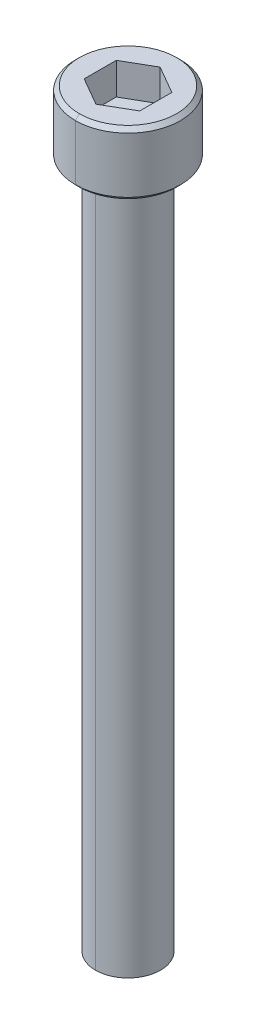
ISO-10303-21;
HEADER;
FILE_DESCRIPTION(('STEP AP214'),'2;1');
FILE_NAME('part.step','',(''),(''),'','','');
FILE_SCHEMA(('AUTOMOTIVE_DESIGN { 1 0 10303 214 1 1 1 1 }'));
ENDSEC;
DATA;
#1=APPLICATION_CONTEXT('core data for automotive mechanical design processes');
#2=APPLICATION_PROTOCOL_DEFINITION('international standard','automotive_design',2000,#1);
#3=PRODUCT_CONTEXT('',#1,'mechanical');
#4=PRODUCT('Part','Part','',(#3));
#5=PRODUCT_RELATED_PRODUCT_CATEGORY('part','',(#4));
#6=PRODUCT_DEFINITION_FORMATION('','',#4);
#7=PRODUCT_DEFINITION_CONTEXT('part definition',#1,'design');
#8=PRODUCT_DEFINITION('design','',#6,#7);
#9=PRODUCT_DEFINITION_SHAPE('','',#8);
#10=(LENGTH_UNIT() NAMED_UNIT(*) SI_UNIT(.MILLI.,.METRE.));
#11=(NAMED_UNIT(*) PLANE_ANGLE_UNIT() SI_UNIT($,.RADIAN.));
#12=(NAMED_UNIT(*) SI_UNIT($,.STERADIAN.) SOLID_ANGLE_UNIT());
#13=UNCERTAINTY_MEASURE_WITH_UNIT(LENGTH_MEASURE(1.E-05),#10,'distance_accuracy_value','');
#14=(GEOMETRIC_REPRESENTATION_CONTEXT(3) GLOBAL_UNCERTAINTY_ASSIGNED_CONTEXT((#13)) GLOBAL_UNIT_ASSIGNED_CONTEXT((#10,
#11,#12)) REPRESENTATION_CONTEXT('',''));
#15=CARTESIAN_POINT('',(0.,0.,0.));
#16=DIRECTION('',(0.,0.,1.));
#17=DIRECTION('',(1.,0.,0.));
#18=AXIS2_PLACEMENT_3D('',#15,#16,#17);
#19=CARTESIAN_POINT('',(0.,-43.91152,0.));
#20=DIRECTION('',(0.,1.,0.));
#21=DIRECTION('',(0.,0.,1.));
#22=AXIS2_PLACEMENT_3D('',#19,#20,#21);
#23=CONICAL_SURFACE('',#22,2.0828,0.960291895410485);
#24=DIRECTION('',(0.,0.573280843383966,-0.819358941251616));
#25=VECTOR('',#24,1.);
#26=CARTESIAN_POINT('',(0.,-43.91152,-2.0828));
#27=LINE('',#26,#25);
#28=CARTESIAN_POINT('',(0.,-44.45,-1.31318));
#29=VERTEX_POINT('',#28);
#30=CARTESIAN_POINT('',(0.,-43.91152,-2.0828));
#31=VERTEX_POINT('',#30);
#32=EDGE_CURVE('E164',#29,#31,#27,.T.);
#33=ORIENTED_EDGE('',*,*,#32,.F.);
#34=CARTESIAN_POINT('',(0.,-44.45,0.));
#35=DIRECTION('',(0.,-1.,0.));
#36=DIRECTION('',(0.,0.,1.));
#37=AXIS2_PLACEMENT_3D('',#34,#35,#36);
#38=CIRCLE('',#37,1.31318);
#39=CARTESIAN_POINT('',(0.,-44.45,1.31318));
#40=VERTEX_POINT('',#39);
#41=EDGE_CURVE('E175',#40,#29,#38,.T.);
#42=ORIENTED_EDGE('',*,*,#41,.F.);
#43=DIRECTION('',(0.,0.573280843383966,0.819358941251616));
#44=VECTOR('',#43,1.);
#45=CARTESIAN_POINT('',(0.,-43.91152,2.0828));
#46=LINE('',#45,#44);
#47=CARTESIAN_POINT('',(0.,-43.91152,2.0828));
#48=VERTEX_POINT('',#47);
#49=EDGE_CURVE('E134',#40,#48,#46,.T.);
#50=ORIENTED_EDGE('',*,*,#49,.T.);
#51=CARTESIAN_POINT('',(0.,-43.91152,0.));
#52=DIRECTION('',(0.,1.,0.));
#53=DIRECTION('',(0.,0.,1.));
#54=AXIS2_PLACEMENT_3D('',#51,#52,#53);
#55=CIRCLE('',#54,2.0828);
#56=EDGE_CURVE('E211',#31,#48,#55,.T.);
#57=ORIENTED_EDGE('',*,*,#56,.F.);
#58=EDGE_LOOP('',(#33,#42,#50,#57));
#59=FACE_BOUND('',#58,.T.);
#60=ADVANCED_FACE('F17',(#59),#23,.T.);
#61=CARTESIAN_POINT('',(0.,0.254,0.));
#62=DIRECTION('',(0.,1.,0.));
#63=DIRECTION('',(0.,0.,1.));
#64=AXIS2_PLACEMENT_3D('',#61,#62,#63);
#65=CONICAL_SURFACE('',#64,3.3655,0.785398163397457);
#66=DIRECTION('',(0.,0.707106781186541,-0.707106781186554));
#67=VECTOR('',#66,1.);
#68=CARTESIAN_POINT('',(0.,0.254,-3.3655));
#69=LINE('',#68,#67);
#70=CARTESIAN_POINT('',(0.,0.,-3.1115));
#71=VERTEX_POINT('',#70);
#72=CARTESIAN_POINT('',(0.,0.254,-3.3655));
#73=VERTEX_POINT('',#72);
#74=EDGE_CURVE('E123',#71,#73,#69,.T.);
#75=ORIENTED_EDGE('',*,*,#74,.F.);
#76=CARTESIAN_POINT('',(0.,0.,0.));
#77=DIRECTION('',(0.,-1.,0.));
#78=DIRECTION('',(0.,0.,1.));
#79=AXIS2_PLACEMENT_3D('',#76,#77,#78);
#80=CIRCLE('',#79,3.1115);
#81=CARTESIAN_POINT('',(0.,0.,3.1115));
#82=VERTEX_POINT('',#81);
#83=EDGE_CURVE('E110',#82,#71,#80,.T.);
#84=ORIENTED_EDGE('',*,*,#83,.F.);
#85=DIRECTION('',(0.,0.707106781186541,0.707106781186554));
#86=VECTOR('',#85,1.);
#87=CARTESIAN_POINT('',(0.,0.254,3.3655));
#88=LINE('',#87,#86);
#89=CARTESIAN_POINT('',(0.,0.254,3.3655));
#90=VERTEX_POINT('',#89);
#91=EDGE_CURVE('E132',#82,#90,#88,.T.);
#92=ORIENTED_EDGE('',*,*,#91,.T.);
#93=CARTESIAN_POINT('',(0.,0.254,0.));
#94=DIRECTION('',(0.,1.,0.));
#95=DIRECTION('',(0.,0.,1.));
#96=AXIS2_PLACEMENT_3D('',#93,#94,#95);
#97=CIRCLE('',#96,3.3655);
#98=EDGE_CURVE('E124',#73,#90,#97,.T.);
#99=ORIENTED_EDGE('',*,*,#98,.F.);
#100=EDGE_LOOP('',(#75,#84,#92,#99));
#101=FACE_BOUND('',#100,.T.);
#102=ADVANCED_FACE('F19',(#101),#65,.T.);
#103=CARTESIAN_POINT('',(0.,4.064,0.));
#104=DIRECTION('',(0.,-1.,0.));
#105=DIRECTION('',(0.,0.,-1.));
#106=AXIS2_PLACEMENT_3D('',#103,#104,#105);
#107=CONICAL_SURFACE('',#106,3.1115,0.785398163397452);
#108=DIRECTION('',(0.,-0.707106781186545,0.707106781186551));
#109=VECTOR('',#108,1.);
#110=CARTESIAN_POINT('',(0.,4.064,3.1115));
#111=LINE('',#110,#109);
#112=CARTESIAN_POINT('',(0.,4.064,3.1115));
#113=VERTEX_POINT('',#112);
#114=CARTESIAN_POINT('',(0.,3.81,3.3655));
#115=VERTEX_POINT('',#114);
#116=EDGE_CURVE('E224',#113,#115,#111,.T.);
#117=ORIENTED_EDGE('',*,*,#116,.F.);
#118=CARTESIAN_POINT('',(0.,4.064,0.));
#119=DIRECTION('',(0.,1.,0.));
#120=DIRECTION('',(0.,0.,1.));
#121=AXIS2_PLACEMENT_3D('',#118,#119,#120);
#122=CIRCLE('',#121,3.1115);
#123=CARTESIAN_POINT('',(0.,4.064,-3.1115));
#124=VERTEX_POINT('',#123);
#125=EDGE_CURVE('E205',#124,#113,#122,.T.);
#126=ORIENTED_EDGE('',*,*,#125,.F.);
#127=DIRECTION('',(0.,-0.707106781186545,-0.707106781186551));
#128=VECTOR('',#127,1.);
#129=CARTESIAN_POINT('',(0.,4.064,-3.1115));
#130=LINE('',#129,#128);
#131=CARTESIAN_POINT('',(0.,3.81,-3.3655));
#132=VERTEX_POINT('',#131);
#133=EDGE_CURVE('E228',#124,#132,#130,.T.);
#134=ORIENTED_EDGE('',*,*,#133,.T.);
#135=CARTESIAN_POINT('',(0.,3.81,0.));
#136=DIRECTION('',(0.,-1.,0.));
#137=DIRECTION('',(0.,0.,1.));
#138=AXIS2_PLACEMENT_3D('',#135,#136,#137);
#139=CIRCLE('',#138,3.3655);
#140=EDGE_CURVE('E172',#115,#132,#139,.T.);
#141=ORIENTED_EDGE('',*,*,#140,.F.);
#142=EDGE_LOOP('',(#117,#126,#134,#141));
#143=FACE_BOUND('',#142,.T.);
#144=ADVANCED_FACE('F371',(#143),#107,.T.);
#145=CARTESIAN_POINT('',(1.778,2.032,3.07958633585746));
#146=DIRECTION('',(0.,1.,0.));
#147=DIRECTION('',(1.,0.,0.));
#148=AXIS2_PLACEMENT_3D('',#145,#146,#147);
#149=PLANE('',#148);
#150=DIRECTION('',(0.86602540378444,0.,0.5));
#151=VECTOR('',#150,1.);
#152=CARTESIAN_POINT('',(-1.778,2.032,1.02652877861917));
#153=LINE('',#152,#151);
#154=CARTESIAN_POINT('',(-1.778,2.032,1.02652877861917));
#155=VERTEX_POINT('',#154);
#156=CARTESIAN_POINT('',(0.,2.032,2.05305755723831));
#157=VERTEX_POINT('',#156);
#158=EDGE_CURVE('E188',#155,#157,#153,.T.);
#159=ORIENTED_EDGE('',*,*,#158,.T.);
#160=DIRECTION('',(0.866025403784439,0.,-0.5));
#161=VECTOR('',#160,1.);
#162=CARTESIAN_POINT('',(0.,2.032,2.05305755723831));
#163=LINE('',#162,#161);
#164=CARTESIAN_POINT('',(1.778,2.032,1.02652877861915));
#165=VERTEX_POINT('',#164);
#166=EDGE_CURVE('E11',#157,#165,#163,.T.);
#167=ORIENTED_EDGE('',*,*,#166,.T.);
#168=DIRECTION('',(0.,0.,-1.));
#169=VECTOR('',#168,1.);
#170=CARTESIAN_POINT('',(1.778,2.032,1.02652877861915));
#171=LINE('',#170,#169);
#172=CARTESIAN_POINT('',(1.778,2.032,-1.02652877861913));
#173=VERTEX_POINT('',#172);
#174=EDGE_CURVE('E192',#165,#173,#171,.T.);
#175=ORIENTED_EDGE('',*,*,#174,.T.);
#176=DIRECTION('',(-0.866025403784439,0.,-0.5));
#177=VECTOR('',#176,1.);
#178=CARTESIAN_POINT('',(1.778,2.032,-1.02652877861913));
#179=LINE('',#178,#177);
#180=CARTESIAN_POINT('',(0.,2.032,-2.05305755723831));
#181=VERTEX_POINT('',#180);
#182=EDGE_CURVE('E191',#173,#181,#179,.T.);
#183=ORIENTED_EDGE('',*,*,#182,.T.);
#184=DIRECTION('',(-0.866025403784439,0.,0.5));
#185=VECTOR('',#184,1.);
#186=CARTESIAN_POINT('',(0.,2.032,-2.05305755723831));
#187=LINE('',#186,#185);
#188=CARTESIAN_POINT('',(-1.778,2.032,-1.02652877861913));
#189=VERTEX_POINT('',#188);
#190=EDGE_CURVE('E146',#181,#189,#187,.T.);
#191=ORIENTED_EDGE('',*,*,#190,.T.);
#192=DIRECTION('',(0.,0.,1.));
#193=VECTOR('',#192,1.);
#194=CARTESIAN_POINT('',(-1.778,2.032,-1.02652877861913));
#195=LINE('',#194,#193);
#196=EDGE_CURVE('E257',#189,#155,#195,.T.);
#197=ORIENTED_EDGE('',*,*,#196,.T.);
#198=EDGE_LOOP('',(#159,#167,#175,#183,#191,#197));
#199=FACE_BOUND('',#198,.T.);
#200=ADVANCED_FACE('F307',(#199),#149,.T.);
#201=CARTESIAN_POINT('',(0.,2.032,2.05305755723831));
#202=DIRECTION('',(0.5,0.,0.866025403784439));
#203=DIRECTION('',(0.,-1.,0.));
#204=AXIS2_PLACEMENT_3D('',#201,#202,#203);
#205=PLANE('',#204);
#206=DIRECTION('',(0.866025403784439,0.,-0.5));
#207=VECTOR('',#206,1.);
#208=CARTESIAN_POINT('',(0.,4.064,2.05305755723831));
#209=LINE('',#208,#207);
#210=CARTESIAN_POINT('',(0.,4.064,2.05305755723831));
#211=VERTEX_POINT('',#210);
#212=CARTESIAN_POINT('',(1.778,4.064,1.02652877861915));
#213=VERTEX_POINT('',#212);
#214=EDGE_CURVE('E120',#211,#213,#209,.T.);
#215=ORIENTED_EDGE('',*,*,#214,.T.);
#216=DIRECTION('',(0.,1.,0.));
#217=VECTOR('',#216,1.);
#218=CARTESIAN_POINT('',(1.778,2.032,1.02652877861915));
#219=LINE('',#218,#217);
#220=EDGE_CURVE('E28',#165,#213,#219,.T.);
#221=ORIENTED_EDGE('',*,*,#220,.F.);
#222=ORIENTED_EDGE('',*,*,#166,.F.);
#223=DIRECTION('',(0.,1.,0.));
#224=VECTOR('',#223,1.);
#225=CARTESIAN_POINT('',(0.,2.032,2.05305755723831));
#226=LINE('',#225,#224);
#227=EDGE_CURVE('E119',#157,#211,#226,.T.);
#228=ORIENTED_EDGE('',*,*,#227,.T.);
#229=EDGE_LOOP('',(#215,#221,#222,#228));
#230=FACE_BOUND('',#229,.T.);
#231=ADVANCED_FACE('F318',(#230),#205,.F.);
#232=CARTESIAN_POINT('',(1.778,2.032,1.02652877861915));
#233=DIRECTION('',(1.,0.,0.));
#234=DIRECTION('',(0.,0.,1.));
#235=AXIS2_PLACEMENT_3D('',#232,#233,#234);
#236=PLANE('',#235);
#237=DIRECTION('',(0.,0.,-1.));
#238=VECTOR('',#237,1.);
#239=CARTESIAN_POINT('',(1.778,4.064,1.02652877861915));
#240=LINE('',#239,#238);
#241=CARTESIAN_POINT('',(1.778,4.064,-1.02652877861913));
#242=VERTEX_POINT('',#241);
#243=EDGE_CURVE('E158',#213,#242,#240,.T.);
#244=ORIENTED_EDGE('',*,*,#243,.T.);
#245=DIRECTION('',(0.,1.,0.));
#246=VECTOR('',#245,1.);
#247=CARTESIAN_POINT('',(1.778,2.032,-1.02652877861913));
#248=LINE('',#247,#246);
#249=EDGE_CURVE('E195',#173,#242,#248,.T.);
#250=ORIENTED_EDGE('',*,*,#249,.F.);
#251=ORIENTED_EDGE('',*,*,#174,.F.);
#252=ORIENTED_EDGE('',*,*,#220,.T.);
#253=EDGE_LOOP('',(#244,#250,#251,#252));
#254=FACE_BOUND('',#253,.T.);
#255=ADVANCED_FACE('F291',(#254),#236,.F.);
#256=CARTESIAN_POINT('',(1.778,2.032,-1.02652877861913));
#257=DIRECTION('',(0.5,0.,-0.866025403784439));
#258=DIRECTION('',(0.,-1.,0.));
#259=AXIS2_PLACEMENT_3D('',#256,#257,#258);
#260=PLANE('',#259);
#261=DIRECTION('',(-0.866025403784439,0.,-0.5));
#262=VECTOR('',#261,1.);
#263=CARTESIAN_POINT('',(1.778,4.064,-1.02652877861913));
#264=LINE('',#263,#262);
#265=CARTESIAN_POINT('',(0.,4.064,-2.05305755723831));
#266=VERTEX_POINT('',#265);
#267=EDGE_CURVE('E185',#242,#266,#264,.T.);
#268=ORIENTED_EDGE('',*,*,#267,.T.);
#269=DIRECTION('',(0.,1.,0.));
#270=VECTOR('',#269,1.);
#271=CARTESIAN_POINT('',(0.,2.032,-2.05305755723831));
#272=LINE('',#271,#270);
#273=EDGE_CURVE('E150',#181,#266,#272,.T.);
#274=ORIENTED_EDGE('',*,*,#273,.F.);
#275=ORIENTED_EDGE('',*,*,#182,.F.);
#276=ORIENTED_EDGE('',*,*,#249,.T.);
#277=EDGE_LOOP('',(#268,#274,#275,#276));
#278=FACE_BOUND('',#277,.T.);
#279=ADVANCED_FACE('F305',(#278),#260,.F.);
#280=CARTESIAN_POINT('',(0.,2.032,-2.05305755723831));
#281=DIRECTION('',(-0.5,0.,-0.866025403784439));
#282=DIRECTION('',(-0.866025403784439,0.,0.5));
#283=AXIS2_PLACEMENT_3D('',#280,#281,#282);
#284=PLANE('',#283);
#285=DIRECTION('',(-0.866025403784439,0.,0.5));
#286=VECTOR('',#285,1.);
#287=CARTESIAN_POINT('',(0.,4.064,-2.05305755723831));
#288=LINE('',#287,#286);
#289=CARTESIAN_POINT('',(-1.778,4.064,-1.02652877861913));
#290=VERTEX_POINT('',#289);
#291=EDGE_CURVE('E180',#266,#290,#288,.T.);
#292=ORIENTED_EDGE('',*,*,#291,.T.);
#293=DIRECTION('',(0.,1.,0.));
#294=VECTOR('',#293,1.);
#295=CARTESIAN_POINT('',(-1.778,2.032,-1.02652877861913));
#296=LINE('',#295,#294);
#297=EDGE_CURVE('E151',#189,#290,#296,.T.);
#298=ORIENTED_EDGE('',*,*,#297,.F.);
#299=ORIENTED_EDGE('',*,*,#190,.F.);
#300=ORIENTED_EDGE('',*,*,#273,.T.);
#301=EDGE_LOOP('',(#292,#298,#299,#300));
#302=FACE_BOUND('',#301,.T.);
#303=ADVANCED_FACE('F312',(#302),#284,.F.);
#304=CARTESIAN_POINT('',(-1.778,2.032,-1.02652877861913));
#305=DIRECTION('',(-1.,0.,0.));
#306=DIRECTION('',(0.,0.,1.));
#307=AXIS2_PLACEMENT_3D('',#304,#305,#306);
#308=PLANE('',#307);
#309=DIRECTION('',(0.,0.,1.));
#310=VECTOR('',#309,1.);
#311=CARTESIAN_POINT('',(-1.778,4.064,-1.02652877861913));
#312=LINE('',#311,#310);
#313=CARTESIAN_POINT('',(-1.778,4.064,1.02652877861917));
#314=VERTEX_POINT('',#313);
#315=EDGE_CURVE('E176',#290,#314,#312,.T.);
#316=ORIENTED_EDGE('',*,*,#315,.T.);
#317=DIRECTION('',(0.,1.,0.));
#318=VECTOR('',#317,1.);
#319=CARTESIAN_POINT('',(-1.778,2.032,1.02652877861917));
#320=LINE('',#319,#318);
#321=EDGE_CURVE('E207',#155,#314,#320,.T.);
#322=ORIENTED_EDGE('',*,*,#321,.F.);
#323=ORIENTED_EDGE('',*,*,#196,.F.);
#324=ORIENTED_EDGE('',*,*,#297,.T.);
#325=EDGE_LOOP('',(#316,#322,#323,#324));
#326=FACE_BOUND('',#325,.T.);
#327=ADVANCED_FACE('F314',(#326),#308,.F.);
#328=CARTESIAN_POINT('',(-1.778,2.032,1.02652877861917));
#329=DIRECTION('',(-0.5,0.,0.866025403784439));
#330=DIRECTION('',(0.,1.,0.));
#331=AXIS2_PLACEMENT_3D('',#328,#329,#330);
#332=PLANE('',#331);
#333=DIRECTION('',(0.86602540378444,0.,0.5));
#334=VECTOR('',#333,1.);
#335=CARTESIAN_POINT('',(-1.778,4.064,1.02652877861917));
#336=LINE('',#335,#334);
#337=EDGE_CURVE('E181',#314,#211,#336,.T.);
#338=ORIENTED_EDGE('',*,*,#337,.T.);
#339=ORIENTED_EDGE('',*,*,#227,.F.);
#340=ORIENTED_EDGE('',*,*,#158,.F.);
#341=ORIENTED_EDGE('',*,*,#321,.T.);
#342=EDGE_LOOP('',(#338,#339,#340,#341));
#343=FACE_BOUND('',#342,.T.);
#344=ADVANCED_FACE('F316',(#343),#332,.F.);
#345=CARTESIAN_POINT('',(0.,0.,0.));
#346=DIRECTION('',(0.,1.,0.));
#347=DIRECTION('',(1.,0.,0.));
#348=AXIS2_PLACEMENT_3D('',#345,#346,#347);
#349=PLANE('',#348);
#350=CARTESIAN_POINT('',(0.,0.,0.));
#351=DIRECTION('',(0.,1.,0.));
#352=DIRECTION('',(0.,0.,1.));
#353=AXIS2_PLACEMENT_3D('',#350,#351,#352);
#354=CIRCLE('',#353,2.0828);
#355=CARTESIAN_POINT('',(0.,0.,2.0828));
#356=VERTEX_POINT('',#355);
#357=CARTESIAN_POINT('',(0.,0.,-2.0828));
#358=VERTEX_POINT('',#357);
#359=EDGE_CURVE('E163',#356,#358,#354,.T.);
#360=ORIENTED_EDGE('',*,*,#359,.T.);
#361=CARTESIAN_POINT('',(0.,0.,0.));
#362=DIRECTION('',(0.,1.,0.));
#363=DIRECTION('',(0.,0.,1.));
#364=AXIS2_PLACEMENT_3D('',#361,#362,#363);
#365=CIRCLE('',#364,2.0828);
#366=EDGE_CURVE('E214',#358,#356,#365,.T.);
#367=ORIENTED_EDGE('',*,*,#366,.T.);
#368=EDGE_LOOP('',(#360,#367));
#369=FACE_BOUND('',#368,.T.);
#370=ORIENTED_EDGE('',*,*,#83,.T.);
#371=CARTESIAN_POINT('',(0.,0.,0.));
#372=DIRECTION('',(0.,-1.,0.));
#373=DIRECTION('',(0.,0.,1.));
#374=AXIS2_PLACEMENT_3D('',#371,#372,#373);
#375=CIRCLE('',#374,3.1115);
#376=EDGE_CURVE('E114',#71,#82,#375,.T.);
#377=ORIENTED_EDGE('',*,*,#376,.T.);
#378=EDGE_LOOP('',(#370,#377));
#379=FACE_BOUND('',#378,.T.);
#380=ADVANCED_FACE('F112',(#369,#379),#349,.F.);
#381=CARTESIAN_POINT('',(0.,4.064,0.));
#382=DIRECTION('',(0.,1.,0.));
#383=DIRECTION('',(1.,0.,0.));
#384=AXIS2_PLACEMENT_3D('',#381,#382,#383);
#385=PLANE('',#384);
#386=ORIENTED_EDGE('',*,*,#337,.F.);
#387=ORIENTED_EDGE('',*,*,#315,.F.);
#388=ORIENTED_EDGE('',*,*,#291,.F.);
#389=ORIENTED_EDGE('',*,*,#267,.F.);
#390=ORIENTED_EDGE('',*,*,#243,.F.);
#391=ORIENTED_EDGE('',*,*,#214,.F.);
#392=EDGE_LOOP('',(#386,#387,#388,#389,#390,#391));
#393=FACE_BOUND('',#392,.T.);
#394=ORIENTED_EDGE('',*,*,#125,.T.);
#395=CARTESIAN_POINT('',(0.,4.064,0.));
#396=DIRECTION('',(0.,1.,0.));
#397=DIRECTION('',(0.,0.,1.));
#398=AXIS2_PLACEMENT_3D('',#395,#396,#397);
#399=CIRCLE('',#398,3.1115);
#400=EDGE_CURVE('E153',#113,#124,#399,.T.);
#401=ORIENTED_EDGE('',*,*,#400,.T.);
#402=EDGE_LOOP('',(#394,#401));
#403=FACE_BOUND('',#402,.T.);
#404=ADVANCED_FACE('F300',(#393,#403),#385,.T.);
#405=CARTESIAN_POINT('',(0.,4.064,0.));
#406=DIRECTION('',(0.,-1.,0.));
#407=DIRECTION('',(0.,0.,-1.));
#408=AXIS2_PLACEMENT_3D('',#405,#406,#407);
#409=CYLINDRICAL_SURFACE('',#408,3.3655);
#410=DIRECTION('',(0.,-1.,0.));
#411=VECTOR('',#410,1.);
#412=CARTESIAN_POINT('',(0.,4.064,3.3655));
#413=LINE('',#412,#411);
#414=EDGE_CURVE('E225',#115,#90,#413,.T.);
#415=ORIENTED_EDGE('',*,*,#414,.F.);
#416=ORIENTED_EDGE('',*,*,#140,.T.);
#417=DIRECTION('',(0.,-1.,0.));
#418=VECTOR('',#417,1.);
#419=CARTESIAN_POINT('',(0.,4.064,-3.3655));
#420=LINE('',#419,#418);
#421=EDGE_CURVE('E21',#132,#73,#420,.T.);
#422=ORIENTED_EDGE('',*,*,#421,.T.);
#423=ORIENTED_EDGE('',*,*,#98,.T.);
#424=EDGE_LOOP('',(#415,#416,#422,#423));
#425=FACE_BOUND('',#424,.T.);
#426=ADVANCED_FACE('F350',(#425),#409,.T.);
#427=CARTESIAN_POINT('',(0.,-44.45,0.));
#428=DIRECTION('',(0.,1.,0.));
#429=DIRECTION('',(1.,0.,0.));
#430=AXIS2_PLACEMENT_3D('',#427,#428,#429);
#431=PLANE('',#430);
#432=ORIENTED_EDGE('',*,*,#41,.T.);
#433=CARTESIAN_POINT('',(0.,-44.45,0.));
#434=DIRECTION('',(0.,-1.,0.));
#435=DIRECTION('',(0.,0.,1.));
#436=AXIS2_PLACEMENT_3D('',#433,#434,#435);
#437=CIRCLE('',#436,1.31318);
#438=EDGE_CURVE('E168',#29,#40,#437,.T.);
#439=ORIENTED_EDGE('',*,*,#438,.T.);
#440=EDGE_LOOP('',(#432,#439));
#441=FACE_BOUND('',#440,.T.);
#442=ADVANCED_FACE('F347',(#441),#431,.F.);
#443=CARTESIAN_POINT('',(0.,-44.45,0.));
#444=DIRECTION('',(0.,1.,0.));
#445=DIRECTION('',(0.,0.,1.));
#446=AXIS2_PLACEMENT_3D('',#443,#444,#445);
#447=CYLINDRICAL_SURFACE('',#446,2.0828);
#448=DIRECTION('',(0.,1.,0.));
#449=VECTOR('',#448,1.);
#450=CARTESIAN_POINT('',(0.,-44.45,-2.0828));
#451=LINE('',#450,#449);
#452=EDGE_CURVE('E159',#31,#358,#451,.T.);
#453=ORIENTED_EDGE('',*,*,#452,.F.);
#454=ORIENTED_EDGE('',*,*,#56,.T.);
#455=DIRECTION('',(0.,1.,0.));
#456=VECTOR('',#455,1.);
#457=CARTESIAN_POINT('',(0.,-44.45,2.0828));
#458=LINE('',#457,#456);
#459=EDGE_CURVE('E215',#48,#356,#458,.T.);
#460=ORIENTED_EDGE('',*,*,#459,.T.);
#461=ORIENTED_EDGE('',*,*,#366,.F.);
#462=EDGE_LOOP('',(#453,#454,#460,#461));
#463=FACE_BOUND('',#462,.T.);
#464=ADVANCED_FACE('F349',(#463),#447,.T.);
#465=CARTESIAN_POINT('',(0.,-44.45,0.));
#466=DIRECTION('',(0.,1.,0.));
#467=DIRECTION('',(0.,0.,1.));
#468=AXIS2_PLACEMENT_3D('',#465,#466,#467);
#469=CYLINDRICAL_SURFACE('',#468,2.0828);
#470=CARTESIAN_POINT('',(0.,-43.91152,0.));
#471=DIRECTION('',(0.,1.,0.));
#472=DIRECTION('',(0.,0.,1.));
#473=AXIS2_PLACEMENT_3D('',#470,#471,#472);
#474=CIRCLE('',#473,2.0828);
#475=EDGE_CURVE('E141',#48,#31,#474,.T.);
#476=ORIENTED_EDGE('',*,*,#475,.T.);
#477=ORIENTED_EDGE('',*,*,#452,.T.);
#478=ORIENTED_EDGE('',*,*,#359,.F.);
#479=ORIENTED_EDGE('',*,*,#459,.F.);
#480=EDGE_LOOP('',(#476,#477,#478,#479));
#481=FACE_BOUND('',#480,.T.);
#482=ADVANCED_FACE('F358',(#481),#469,.T.);
#483=CARTESIAN_POINT('',(0.,4.064,0.));
#484=DIRECTION('',(0.,-1.,0.));
#485=DIRECTION('',(0.,0.,-1.));
#486=AXIS2_PLACEMENT_3D('',#483,#484,#485);
#487=CYLINDRICAL_SURFACE('',#486,3.3655);
#488=CARTESIAN_POINT('',(0.,3.81,0.));
#489=DIRECTION('',(0.,-1.,0.));
#490=DIRECTION('',(0.,0.,1.));
#491=AXIS2_PLACEMENT_3D('',#488,#489,#490);
#492=CIRCLE('',#491,3.3655);
#493=EDGE_CURVE('E237',#132,#115,#492,.T.);
#494=ORIENTED_EDGE('',*,*,#493,.T.);
#495=ORIENTED_EDGE('',*,*,#414,.T.);
#496=CARTESIAN_POINT('',(0.,0.254,0.));
#497=DIRECTION('',(0.,1.,0.));
#498=DIRECTION('',(0.,0.,1.));
#499=AXIS2_PLACEMENT_3D('',#496,#497,#498);
#500=CIRCLE('',#499,3.3655);
#501=EDGE_CURVE('E129',#90,#73,#500,.T.);
#502=ORIENTED_EDGE('',*,*,#501,.T.);
#503=ORIENTED_EDGE('',*,*,#421,.F.);
#504=EDGE_LOOP('',(#494,#495,#502,#503));
#505=FACE_BOUND('',#504,.T.);
#506=ADVANCED_FACE('F375',(#505),#487,.T.);
#507=CARTESIAN_POINT('',(0.,4.064,0.));
#508=DIRECTION('',(0.,-1.,0.));
#509=DIRECTION('',(0.,0.,-1.));
#510=AXIS2_PLACEMENT_3D('',#507,#508,#509);
#511=CONICAL_SURFACE('',#510,3.1115,0.785398163397452);
#512=ORIENTED_EDGE('',*,*,#400,.F.);
#513=ORIENTED_EDGE('',*,*,#116,.T.);
#514=ORIENTED_EDGE('',*,*,#493,.F.);
#515=ORIENTED_EDGE('',*,*,#133,.F.);
#516=EDGE_LOOP('',(#512,#513,#514,#515));
#517=FACE_BOUND('',#516,.T.);
#518=ADVANCED_FACE('F377',(#517),#511,.T.);
#519=CARTESIAN_POINT('',(0.,0.254,0.));
#520=DIRECTION('',(0.,1.,0.));
#521=DIRECTION('',(0.,0.,1.));
#522=AXIS2_PLACEMENT_3D('',#519,#520,#521);
#523=CONICAL_SURFACE('',#522,3.3655,0.785398163397457);
#524=ORIENTED_EDGE('',*,*,#376,.F.);
#525=ORIENTED_EDGE('',*,*,#74,.T.);
#526=ORIENTED_EDGE('',*,*,#501,.F.);
#527=ORIENTED_EDGE('',*,*,#91,.F.);
#528=EDGE_LOOP('',(#524,#525,#526,#527));
#529=FACE_BOUND('',#528,.T.);
#530=ADVANCED_FACE('F131',(#529),#523,.T.);
#531=CARTESIAN_POINT('',(0.,-43.91152,0.));
#532=DIRECTION('',(0.,1.,0.));
#533=DIRECTION('',(0.,0.,1.));
#534=AXIS2_PLACEMENT_3D('',#531,#532,#533);
#535=CONICAL_SURFACE('',#534,2.0828,0.960291895410485);
#536=ORIENTED_EDGE('',*,*,#438,.F.);
#537=ORIENTED_EDGE('',*,*,#32,.T.);
#538=ORIENTED_EDGE('',*,*,#475,.F.);
#539=ORIENTED_EDGE('',*,*,#49,.F.);
#540=EDGE_LOOP('',(#536,#537,#538,#539));
#541=FACE_BOUND('',#540,.T.);
#542=ADVANCED_FACE('F346',(#541),#535,.T.);
#543=CLOSED_SHELL('',(#60,#102,#144,#200,#231,#255,#279,#303,#327,#344,#380,#404,#426,#442,#464,
#482,#506,#518,#530,#542));
#544=MANIFOLD_SOLID_BREP('B1',#543);
#545=ADVANCED_BREP_SHAPE_REPRESENTATION('',(#18,#544),#14);
#546=SHAPE_DEFINITION_REPRESENTATION(#9,#545);
ENDSEC;
END-ISO-10303-21;
